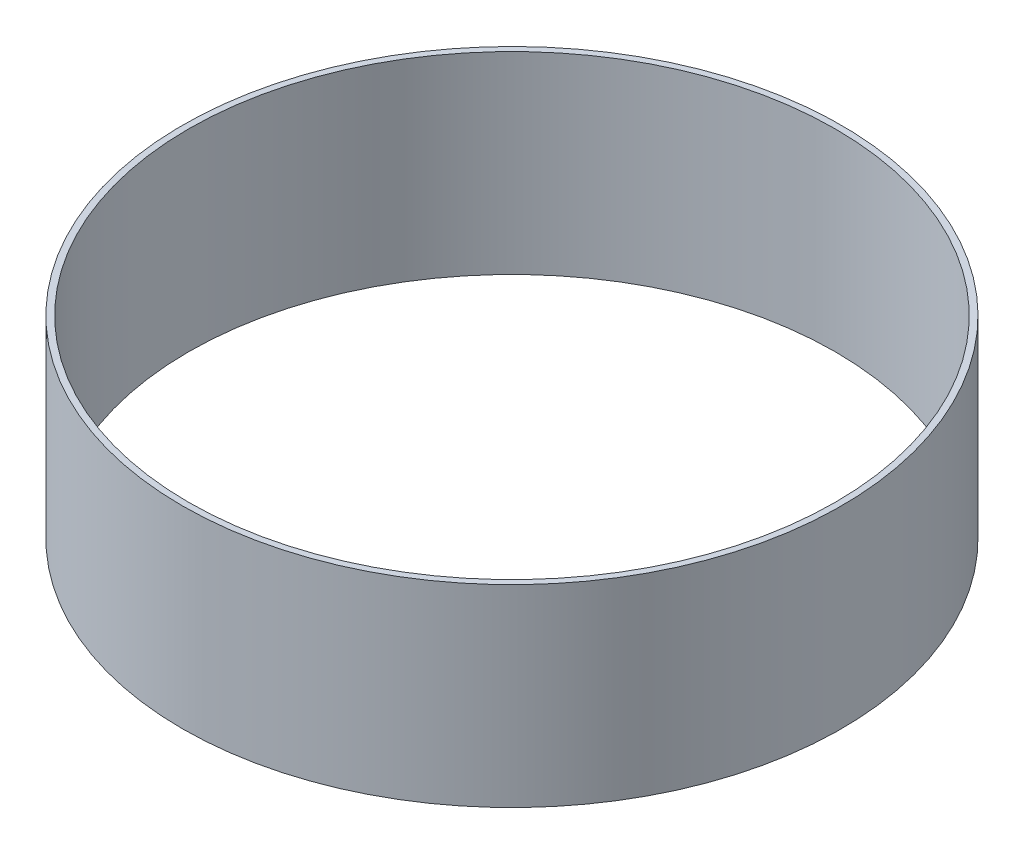
ISO-10303-21;
HEADER;
FILE_DESCRIPTION(('STEP AP214'),'2;1');
FILE_NAME('part.step','',(''),(''),'','','');
FILE_SCHEMA(('AUTOMOTIVE_DESIGN { 1 0 10303 214 1 1 1 1 }'));
ENDSEC;
DATA;
#1=APPLICATION_CONTEXT('core data for automotive mechanical design processes');
#2=APPLICATION_PROTOCOL_DEFINITION('international standard','automotive_design',2000,#1);
#3=PRODUCT_CONTEXT('',#1,'mechanical');
#4=PRODUCT('Part','Part','',(#3));
#5=PRODUCT_RELATED_PRODUCT_CATEGORY('part','',(#4));
#6=PRODUCT_DEFINITION_FORMATION('','',#4);
#7=PRODUCT_DEFINITION_CONTEXT('part definition',#1,'design');
#8=PRODUCT_DEFINITION('design','',#6,#7);
#9=PRODUCT_DEFINITION_SHAPE('','',#8);
#10=(LENGTH_UNIT() NAMED_UNIT(*) SI_UNIT(.MILLI.,.METRE.));
#11=(NAMED_UNIT(*) PLANE_ANGLE_UNIT() SI_UNIT($,.RADIAN.));
#12=(NAMED_UNIT(*) SI_UNIT($,.STERADIAN.) SOLID_ANGLE_UNIT());
#13=UNCERTAINTY_MEASURE_WITH_UNIT(LENGTH_MEASURE(1.E-05),#10,'distance_accuracy_value','');
#14=(GEOMETRIC_REPRESENTATION_CONTEXT(3) GLOBAL_UNCERTAINTY_ASSIGNED_CONTEXT((#13)) GLOBAL_UNIT_ASSIGNED_CONTEXT((#10,
#11,#12)) REPRESENTATION_CONTEXT('',''));
#15=CARTESIAN_POINT('',(0.,0.,0.));
#16=DIRECTION('',(0.,0.,1.));
#17=DIRECTION('',(1.,0.,0.));
#18=AXIS2_PLACEMENT_3D('',#15,#16,#17);
#19=CARTESIAN_POINT('',(0.,19.3802,0.));
#20=DIRECTION('',(0.,1.,0.));
#21=DIRECTION('',(0.,0.,1.));
#22=AXIS2_PLACEMENT_3D('',#19,#20,#21);
#23=PLANE('',#22);
#24=CARTESIAN_POINT('',(0.,19.3802,0.));
#25=DIRECTION('',(0.,1.,0.));
#26=DIRECTION('',(0.,0.,1.));
#27=AXIS2_PLACEMENT_3D('',#24,#25,#26);
#28=CIRCLE('',#27,33.0835);
#29=CARTESIAN_POINT('',(0.,19.3802,33.0835));
#30=VERTEX_POINT('',#29);
#31=EDGE_CURVE('E10',#30,#30,#28,.T.);
#32=ORIENTED_EDGE('',*,*,#31,.T.);
#33=EDGE_LOOP('',(#32));
#34=FACE_BOUND('',#33,.T.);
#35=CARTESIAN_POINT('',(0.,19.3802,0.));
#36=DIRECTION('',(0.,1.,0.));
#37=DIRECTION('',(0.,0.,1.));
#38=AXIS2_PLACEMENT_3D('',#35,#36,#37);
#39=CIRCLE('',#38,32.4612);
#40=CARTESIAN_POINT('',(0.,19.3802,32.4612));
#41=VERTEX_POINT('',#40);
#42=EDGE_CURVE('E52',#41,#41,#39,.T.);
#43=ORIENTED_EDGE('',*,*,#42,.F.);
#44=EDGE_LOOP('',(#43));
#45=FACE_BOUND('',#44,.T.);
#46=ADVANCED_FACE('F41',(#34,#45),#23,.T.);
#47=CARTESIAN_POINT('',(0.,0.,0.));
#48=DIRECTION('',(0.,1.,0.));
#49=DIRECTION('',(0.,0.,1.));
#50=AXIS2_PLACEMENT_3D('',#47,#48,#49);
#51=PLANE('',#50);
#52=CARTESIAN_POINT('',(0.,0.,0.));
#53=DIRECTION('',(0.,1.,0.));
#54=DIRECTION('',(0.,0.,1.));
#55=AXIS2_PLACEMENT_3D('',#52,#53,#54);
#56=CIRCLE('',#55,33.0835);
#57=CARTESIAN_POINT('',(0.,0.,33.0835));
#58=VERTEX_POINT('',#57);
#59=EDGE_CURVE('E45',#58,#58,#56,.T.);
#60=ORIENTED_EDGE('',*,*,#59,.F.);
#61=EDGE_LOOP('',(#60));
#62=FACE_BOUND('',#61,.T.);
#63=CARTESIAN_POINT('',(0.,0.,0.));
#64=DIRECTION('',(0.,1.,0.));
#65=DIRECTION('',(0.,0.,1.));
#66=AXIS2_PLACEMENT_3D('',#63,#64,#65);
#67=CIRCLE('',#66,32.4612);
#68=CARTESIAN_POINT('',(0.,0.,32.4612));
#69=VERTEX_POINT('',#68);
#70=EDGE_CURVE('E54',#69,#69,#67,.T.);
#71=ORIENTED_EDGE('',*,*,#70,.T.);
#72=EDGE_LOOP('',(#71));
#73=FACE_BOUND('',#72,.T.);
#74=ADVANCED_FACE('F64',(#62,#73),#51,.F.);
#75=CARTESIAN_POINT('',(0.,19.3802,0.));
#76=DIRECTION('',(0.,-1.,0.));
#77=DIRECTION('',(0.,0.,-1.));
#78=AXIS2_PLACEMENT_3D('',#75,#76,#77);
#79=CYLINDRICAL_SURFACE('',#78,33.0835);
#80=ORIENTED_EDGE('',*,*,#31,.F.);
#81=EDGE_LOOP('',(#80));
#82=FACE_BOUND('',#81,.T.);
#83=ORIENTED_EDGE('',*,*,#59,.T.);
#84=EDGE_LOOP('',(#83));
#85=FACE_BOUND('',#84,.T.);
#86=ADVANCED_FACE('F43',(#82,#85),#79,.T.);
#87=CARTESIAN_POINT('',(0.,19.3802,0.));
#88=DIRECTION('',(0.,-1.,0.));
#89=DIRECTION('',(0.,0.,-1.));
#90=AXIS2_PLACEMENT_3D('',#87,#88,#89);
#91=CYLINDRICAL_SURFACE('',#90,32.4612);
#92=ORIENTED_EDGE('',*,*,#42,.T.);
#93=EDGE_LOOP('',(#92));
#94=FACE_BOUND('',#93,.T.);
#95=ORIENTED_EDGE('',*,*,#70,.F.);
#96=EDGE_LOOP('',(#95));
#97=FACE_BOUND('',#96,.T.);
#98=ADVANCED_FACE('F60',(#94,#97),#91,.F.);
#99=CLOSED_SHELL('',(#46,#74,#86,#98));
#100=MANIFOLD_SOLID_BREP('B2',#99);
#101=ADVANCED_BREP_SHAPE_REPRESENTATION('',(#18,#100),#14);
#102=SHAPE_DEFINITION_REPRESENTATION(#9,#101);
ENDSEC;
END-ISO-10303-21;
